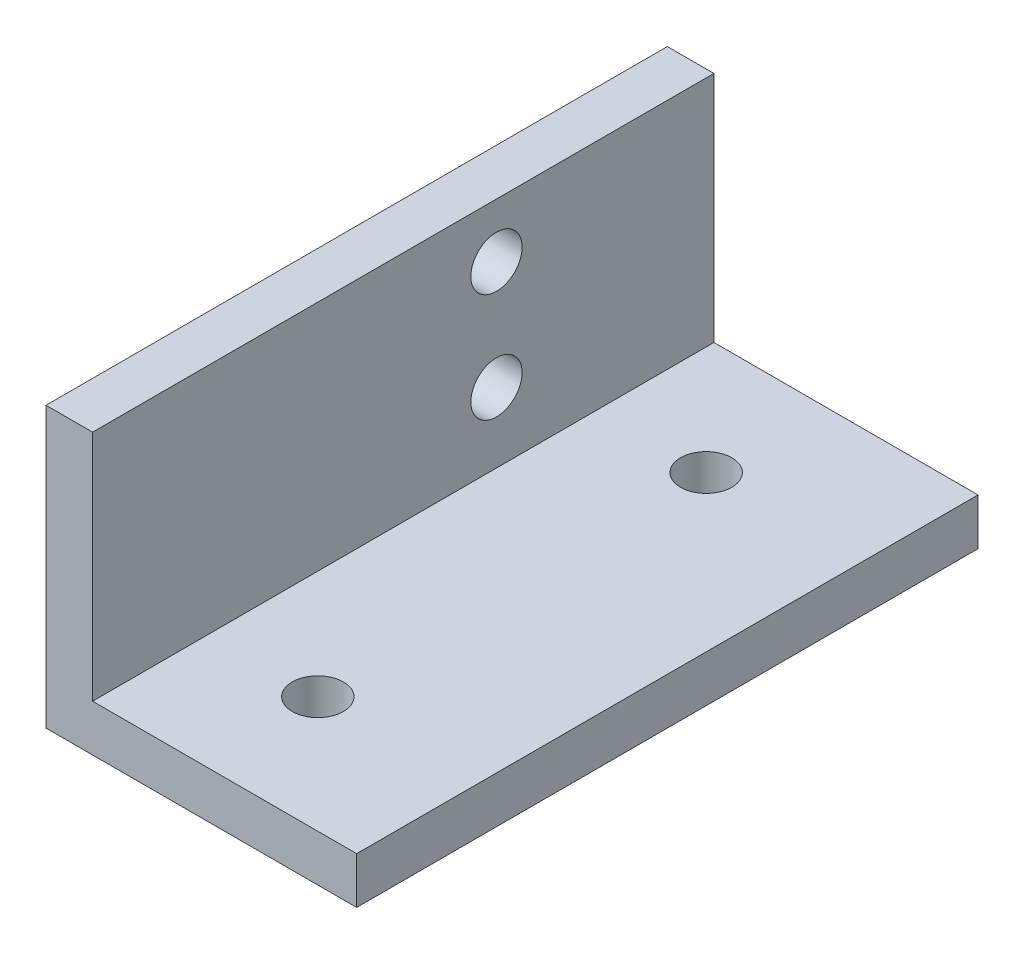
ISO-10303-21;
HEADER;
FILE_DESCRIPTION(('STEP AP214'),'2;1');
FILE_NAME('part.step','',(''),(''),'','','');
FILE_SCHEMA(('AUTOMOTIVE_DESIGN { 1 0 10303 214 1 1 1 1 }'));
ENDSEC;
DATA;
#1=APPLICATION_CONTEXT('core data for automotive mechanical design processes');
#2=APPLICATION_PROTOCOL_DEFINITION('international standard','automotive_design',2000,#1);
#3=PRODUCT_CONTEXT('',#1,'mechanical');
#4=PRODUCT('Part','Part','',(#3));
#5=PRODUCT_RELATED_PRODUCT_CATEGORY('part','',(#4));
#6=PRODUCT_DEFINITION_FORMATION('','',#4);
#7=PRODUCT_DEFINITION_CONTEXT('part definition',#1,'design');
#8=PRODUCT_DEFINITION('design','',#6,#7);
#9=PRODUCT_DEFINITION_SHAPE('','',#8);
#10=(LENGTH_UNIT() NAMED_UNIT(*) SI_UNIT(.MILLI.,.METRE.));
#11=(NAMED_UNIT(*) PLANE_ANGLE_UNIT() SI_UNIT($,.RADIAN.));
#12=(NAMED_UNIT(*) SI_UNIT($,.STERADIAN.) SOLID_ANGLE_UNIT());
#13=UNCERTAINTY_MEASURE_WITH_UNIT(LENGTH_MEASURE(1.E-05),#10,'distance_accuracy_value','');
#14=(GEOMETRIC_REPRESENTATION_CONTEXT(3) GLOBAL_UNCERTAINTY_ASSIGNED_CONTEXT((#13)) GLOBAL_UNIT_ASSIGNED_CONTEXT((#10,
#11,#12)) REPRESENTATION_CONTEXT('',''));
#15=CARTESIAN_POINT('',(0.,0.,0.));
#16=DIRECTION('',(0.,0.,1.));
#17=DIRECTION('',(1.,0.,0.));
#18=AXIS2_PLACEMENT_3D('',#15,#16,#17);
#19=CARTESIAN_POINT('',(20.,0.,40.));
#20=DIRECTION('',(-1.,0.,0.));
#21=DIRECTION('',(0.,0.,1.));
#22=AXIS2_PLACEMENT_3D('',#19,#20,#21);
#23=PLANE('',#22);
#24=DIRECTION('',(0.,1.,0.));
#25=VECTOR('',#24,1.);
#26=CARTESIAN_POINT('',(20.,0.,0.));
#27=LINE('',#26,#25);
#28=CARTESIAN_POINT('',(20.,0.,0.));
#29=VERTEX_POINT('',#28);
#30=CARTESIAN_POINT('',(20.,3.,0.));
#31=VERTEX_POINT('',#30);
#32=EDGE_CURVE('E117',#29,#31,#27,.T.);
#33=ORIENTED_EDGE('',*,*,#32,.T.);
#34=DIRECTION('',(0.,0.,-1.));
#35=VECTOR('',#34,1.);
#36=CARTESIAN_POINT('',(20.,3.,40.));
#37=LINE('',#36,#35);
#38=CARTESIAN_POINT('',(20.,3.,40.));
#39=VERTEX_POINT('',#38);
#40=EDGE_CURVE('E11',#39,#31,#37,.T.);
#41=ORIENTED_EDGE('',*,*,#40,.F.);
#42=DIRECTION('',(0.,1.,0.));
#43=VECTOR('',#42,1.);
#44=CARTESIAN_POINT('',(20.,0.,40.));
#45=LINE('',#44,#43);
#46=CARTESIAN_POINT('',(20.,0.,40.));
#47=VERTEX_POINT('',#46);
#48=EDGE_CURVE('E128',#47,#39,#45,.T.);
#49=ORIENTED_EDGE('',*,*,#48,.F.);
#50=DIRECTION('',(0.,0.,-1.));
#51=VECTOR('',#50,1.);
#52=CARTESIAN_POINT('',(20.,0.,40.));
#53=LINE('',#52,#51);
#54=EDGE_CURVE('E113',#47,#29,#53,.T.);
#55=ORIENTED_EDGE('',*,*,#54,.T.);
#56=EDGE_LOOP('',(#33,#41,#49,#55));
#57=FACE_BOUND('',#56,.T.);
#58=ADVANCED_FACE('F33',(#57),#23,.F.);
#59=CARTESIAN_POINT('',(20.,3.,40.));
#60=DIRECTION('',(0.,-1.,0.));
#61=DIRECTION('',(1.,0.,0.));
#62=AXIS2_PLACEMENT_3D('',#59,#60,#61);
#63=PLANE('',#62);
#64=CARTESIAN_POINT('',(10.,3.,32.5));
#65=DIRECTION('',(0.,-1.,0.));
#66=DIRECTION('',(1.,0.,0.));
#67=AXIS2_PLACEMENT_3D('',#64,#65,#66);
#68=CIRCLE('',#67,1.65);
#69=CARTESIAN_POINT('',(11.65,3.,32.5));
#70=VERTEX_POINT('',#69);
#71=EDGE_CURVE('E262',#70,#70,#68,.T.);
#72=ORIENTED_EDGE('',*,*,#71,.T.);
#73=EDGE_LOOP('',(#72));
#74=FACE_BOUND('',#73,.T.);
#75=CARTESIAN_POINT('',(10.,3.,7.5));
#76=DIRECTION('',(0.,-1.,0.));
#77=DIRECTION('',(1.,0.,0.));
#78=AXIS2_PLACEMENT_3D('',#75,#76,#77);
#79=CIRCLE('',#78,1.65);
#80=CARTESIAN_POINT('',(11.65,3.,7.5));
#81=VERTEX_POINT('',#80);
#82=EDGE_CURVE('E121',#81,#81,#79,.T.);
#83=ORIENTED_EDGE('',*,*,#82,.T.);
#84=EDGE_LOOP('',(#83));
#85=FACE_BOUND('',#84,.T.);
#86=DIRECTION('',(-1.,0.,0.));
#87=VECTOR('',#86,1.);
#88=CARTESIAN_POINT('',(20.,3.,0.));
#89=LINE('',#88,#87);
#90=CARTESIAN_POINT('',(3.,3.,0.));
#91=VERTEX_POINT('',#90);
#92=EDGE_CURVE('E120',#31,#91,#89,.T.);
#93=ORIENTED_EDGE('',*,*,#92,.T.);
#94=DIRECTION('',(0.,0.,-1.));
#95=VECTOR('',#94,1.);
#96=CARTESIAN_POINT('',(3.,3.,40.));
#97=LINE('',#96,#95);
#98=CARTESIAN_POINT('',(3.,3.,40.));
#99=VERTEX_POINT('',#98);
#100=EDGE_CURVE('E41',#99,#91,#97,.T.);
#101=ORIENTED_EDGE('',*,*,#100,.F.);
#102=DIRECTION('',(-1.,0.,0.));
#103=VECTOR('',#102,1.);
#104=CARTESIAN_POINT('',(20.,3.,40.));
#105=LINE('',#104,#103);
#106=EDGE_CURVE('E86',#39,#99,#105,.T.);
#107=ORIENTED_EDGE('',*,*,#106,.F.);
#108=ORIENTED_EDGE('',*,*,#40,.T.);
#109=EDGE_LOOP('',(#93,#101,#107,#108));
#110=FACE_BOUND('',#109,.T.);
#111=ADVANCED_FACE('F156',(#74,#85,#110),#63,.F.);
#112=CARTESIAN_POINT('',(3.,3.,40.));
#113=DIRECTION('',(-1.,0.,0.));
#114=DIRECTION('',(0.,0.,1.));
#115=AXIS2_PLACEMENT_3D('',#112,#113,#114);
#116=PLANE('',#115);
#117=CARTESIAN_POINT('',(3.,14.5,14.));
#118=DIRECTION('',(-1.,0.,0.));
#119=DIRECTION('',(0.,0.,1.));
#120=AXIS2_PLACEMENT_3D('',#117,#118,#119);
#121=CIRCLE('',#120,1.65);
#122=CARTESIAN_POINT('',(3.,14.5,15.65));
#123=VERTEX_POINT('',#122);
#124=EDGE_CURVE('E277',#123,#123,#121,.T.);
#125=ORIENTED_EDGE('',*,*,#124,.T.);
#126=EDGE_LOOP('',(#125));
#127=FACE_BOUND('',#126,.T.);
#128=CARTESIAN_POINT('',(3.,7.5,14.));
#129=DIRECTION('',(-1.,0.,0.));
#130=DIRECTION('',(0.,0.,1.));
#131=AXIS2_PLACEMENT_3D('',#128,#129,#130);
#132=CIRCLE('',#131,1.65);
#133=CARTESIAN_POINT('',(3.,7.5,15.65));
#134=VERTEX_POINT('',#133);
#135=EDGE_CURVE('E271',#134,#134,#132,.T.);
#136=ORIENTED_EDGE('',*,*,#135,.T.);
#137=EDGE_LOOP('',(#136));
#138=FACE_BOUND('',#137,.T.);
#139=DIRECTION('',(0.,1.,0.));
#140=VECTOR('',#139,1.);
#141=CARTESIAN_POINT('',(3.,3.,0.));
#142=LINE('',#141,#140);
#143=CARTESIAN_POINT('',(3.,18.,0.));
#144=VERTEX_POINT('',#143);
#145=EDGE_CURVE('E123',#91,#144,#142,.T.);
#146=ORIENTED_EDGE('',*,*,#145,.T.);
#147=DIRECTION('',(0.,0.,-1.));
#148=VECTOR('',#147,1.);
#149=CARTESIAN_POINT('',(3.,18.,40.));
#150=LINE('',#149,#148);
#151=CARTESIAN_POINT('',(3.,18.,40.));
#152=VERTEX_POINT('',#151);
#153=EDGE_CURVE('E108',#152,#144,#150,.T.);
#154=ORIENTED_EDGE('',*,*,#153,.F.);
#155=DIRECTION('',(0.,1.,0.));
#156=VECTOR('',#155,1.);
#157=CARTESIAN_POINT('',(3.,3.,40.));
#158=LINE('',#157,#156);
#159=EDGE_CURVE('E99',#99,#152,#158,.T.);
#160=ORIENTED_EDGE('',*,*,#159,.F.);
#161=ORIENTED_EDGE('',*,*,#100,.T.);
#162=EDGE_LOOP('',(#146,#154,#160,#161));
#163=FACE_BOUND('',#162,.T.);
#164=ADVANCED_FACE('F134',(#127,#138,#163),#116,.F.);
#165=CARTESIAN_POINT('',(0.,18.,40.));
#166=DIRECTION('',(0.,-1.,0.));
#167=DIRECTION('',(0.,0.,-1.));
#168=AXIS2_PLACEMENT_3D('',#165,#166,#167);
#169=PLANE('',#168);
#170=DIRECTION('',(-1.,0.,0.));
#171=VECTOR('',#170,1.);
#172=CARTESIAN_POINT('',(0.,18.,0.));
#173=LINE('',#172,#171);
#174=CARTESIAN_POINT('',(0.,18.,0.));
#175=VERTEX_POINT('',#174);
#176=EDGE_CURVE('E107',#144,#175,#173,.T.);
#177=ORIENTED_EDGE('',*,*,#176,.T.);
#178=DIRECTION('',(0.,0.,-1.));
#179=VECTOR('',#178,1.);
#180=CARTESIAN_POINT('',(0.,18.,40.));
#181=LINE('',#180,#179);
#182=CARTESIAN_POINT('',(0.,18.,40.));
#183=VERTEX_POINT('',#182);
#184=EDGE_CURVE('E104',#183,#175,#181,.T.);
#185=ORIENTED_EDGE('',*,*,#184,.F.);
#186=DIRECTION('',(-1.,0.,0.));
#187=VECTOR('',#186,1.);
#188=CARTESIAN_POINT('',(0.,18.,40.));
#189=LINE('',#188,#187);
#190=EDGE_CURVE('E93',#152,#183,#189,.T.);
#191=ORIENTED_EDGE('',*,*,#190,.F.);
#192=ORIENTED_EDGE('',*,*,#153,.T.);
#193=EDGE_LOOP('',(#177,#185,#191,#192));
#194=FACE_BOUND('',#193,.T.);
#195=ADVANCED_FACE('F105',(#194),#169,.F.);
#196=CARTESIAN_POINT('',(0.,0.,40.));
#197=DIRECTION('',(1.,0.,0.));
#198=DIRECTION('',(0.,0.,-1.));
#199=AXIS2_PLACEMENT_3D('',#196,#197,#198);
#200=PLANE('',#199);
#201=CARTESIAN_POINT('',(0.,14.5,14.));
#202=DIRECTION('',(-1.,0.,0.));
#203=DIRECTION('',(0.,0.,1.));
#204=AXIS2_PLACEMENT_3D('',#201,#202,#203);
#205=CIRCLE('',#204,1.65);
#206=CARTESIAN_POINT('',(0.,14.5,15.65));
#207=VERTEX_POINT('',#206);
#208=EDGE_CURVE('E280',#207,#207,#205,.T.);
#209=ORIENTED_EDGE('',*,*,#208,.F.);
#210=EDGE_LOOP('',(#209));
#211=FACE_BOUND('',#210,.T.);
#212=CARTESIAN_POINT('',(0.,7.5,14.));
#213=DIRECTION('',(-1.,0.,0.));
#214=DIRECTION('',(0.,0.,1.));
#215=AXIS2_PLACEMENT_3D('',#212,#213,#214);
#216=CIRCLE('',#215,1.65);
#217=CARTESIAN_POINT('',(0.,7.5,15.65));
#218=VERTEX_POINT('',#217);
#219=EDGE_CURVE('E274',#218,#218,#216,.T.);
#220=ORIENTED_EDGE('',*,*,#219,.F.);
#221=EDGE_LOOP('',(#220));
#222=FACE_BOUND('',#221,.T.);
#223=DIRECTION('',(0.,-1.,0.));
#224=VECTOR('',#223,1.);
#225=CARTESIAN_POINT('',(0.,0.,0.));
#226=LINE('',#225,#224);
#227=CARTESIAN_POINT('',(0.,0.,0.));
#228=VERTEX_POINT('',#227);
#229=EDGE_CURVE('E72',#175,#228,#226,.T.);
#230=ORIENTED_EDGE('',*,*,#229,.T.);
#231=DIRECTION('',(0.,0.,-1.));
#232=VECTOR('',#231,1.);
#233=CARTESIAN_POINT('',(0.,0.,40.));
#234=LINE('',#233,#232);
#235=CARTESIAN_POINT('',(0.,0.,40.));
#236=VERTEX_POINT('',#235);
#237=EDGE_CURVE('E109',#236,#228,#234,.T.);
#238=ORIENTED_EDGE('',*,*,#237,.F.);
#239=DIRECTION('',(0.,-1.,0.));
#240=VECTOR('',#239,1.);
#241=CARTESIAN_POINT('',(0.,0.,40.));
#242=LINE('',#241,#240);
#243=EDGE_CURVE('E97',#183,#236,#242,.T.);
#244=ORIENTED_EDGE('',*,*,#243,.F.);
#245=ORIENTED_EDGE('',*,*,#184,.T.);
#246=EDGE_LOOP('',(#230,#238,#244,#245));
#247=FACE_BOUND('',#246,.T.);
#248=ADVANCED_FACE('F111',(#211,#222,#247),#200,.F.);
#249=CARTESIAN_POINT('',(20.,0.,40.));
#250=DIRECTION('',(0.,1.,0.));
#251=DIRECTION('',(-1.,0.,0.));
#252=AXIS2_PLACEMENT_3D('',#249,#250,#251);
#253=PLANE('',#252);
#254=CARTESIAN_POINT('',(10.,0.,32.5));
#255=DIRECTION('',(0.,-1.,0.));
#256=DIRECTION('',(1.,0.,0.));
#257=AXIS2_PLACEMENT_3D('',#254,#255,#256);
#258=CIRCLE('',#257,1.65);
#259=CARTESIAN_POINT('',(11.65,0.,32.5));
#260=VERTEX_POINT('',#259);
#261=EDGE_CURVE('E268',#260,#260,#258,.T.);
#262=ORIENTED_EDGE('',*,*,#261,.F.);
#263=EDGE_LOOP('',(#262));
#264=FACE_BOUND('',#263,.T.);
#265=CARTESIAN_POINT('',(10.,0.,7.5));
#266=DIRECTION('',(0.,-1.,0.));
#267=DIRECTION('',(1.,0.,0.));
#268=AXIS2_PLACEMENT_3D('',#265,#266,#267);
#269=CIRCLE('',#268,1.65);
#270=CARTESIAN_POINT('',(11.65,0.,7.5));
#271=VERTEX_POINT('',#270);
#272=EDGE_CURVE('E258',#271,#271,#269,.T.);
#273=ORIENTED_EDGE('',*,*,#272,.F.);
#274=EDGE_LOOP('',(#273));
#275=FACE_BOUND('',#274,.T.);
#276=DIRECTION('',(1.,0.,0.));
#277=VECTOR('',#276,1.);
#278=CARTESIAN_POINT('',(20.,0.,0.));
#279=LINE('',#278,#277);
#280=EDGE_CURVE('E78',#228,#29,#279,.T.);
#281=ORIENTED_EDGE('',*,*,#280,.T.);
#282=ORIENTED_EDGE('',*,*,#54,.F.);
#283=DIRECTION('',(1.,0.,0.));
#284=VECTOR('',#283,1.);
#285=CARTESIAN_POINT('',(20.,0.,40.));
#286=LINE('',#285,#284);
#287=EDGE_CURVE('E49',#236,#47,#286,.T.);
#288=ORIENTED_EDGE('',*,*,#287,.F.);
#289=ORIENTED_EDGE('',*,*,#237,.T.);
#290=EDGE_LOOP('',(#281,#282,#288,#289));
#291=FACE_BOUND('',#290,.T.);
#292=ADVANCED_FACE('F141',(#264,#275,#291),#253,.F.);
#293=CARTESIAN_POINT('',(0.,0.,40.));
#294=DIRECTION('',(0.,0.,1.));
#295=DIRECTION('',(1.,0.,0.));
#296=AXIS2_PLACEMENT_3D('',#293,#294,#295);
#297=PLANE('',#296);
#298=ORIENTED_EDGE('',*,*,#48,.T.);
#299=ORIENTED_EDGE('',*,*,#106,.T.);
#300=ORIENTED_EDGE('',*,*,#159,.T.);
#301=ORIENTED_EDGE('',*,*,#190,.T.);
#302=ORIENTED_EDGE('',*,*,#243,.T.);
#303=ORIENTED_EDGE('',*,*,#287,.T.);
#304=EDGE_LOOP('',(#298,#299,#300,#301,#302,#303));
#305=FACE_BOUND('',#304,.T.);
#306=ADVANCED_FACE('F95',(#305),#297,.T.);
#307=CARTESIAN_POINT('',(0.,0.,0.));
#308=DIRECTION('',(0.,0.,1.));
#309=DIRECTION('',(1.,0.,0.));
#310=AXIS2_PLACEMENT_3D('',#307,#308,#309);
#311=PLANE('',#310);
#312=ORIENTED_EDGE('',*,*,#32,.F.);
#313=ORIENTED_EDGE('',*,*,#280,.F.);
#314=ORIENTED_EDGE('',*,*,#229,.F.);
#315=ORIENTED_EDGE('',*,*,#176,.F.);
#316=ORIENTED_EDGE('',*,*,#145,.F.);
#317=ORIENTED_EDGE('',*,*,#92,.F.);
#318=EDGE_LOOP('',(#312,#313,#314,#315,#316,#317));
#319=FACE_BOUND('',#318,.T.);
#320=ADVANCED_FACE('F137',(#319),#311,.F.);
#321=CARTESIAN_POINT('',(10.,40.,7.5));
#322=DIRECTION('',(0.,-1.,0.));
#323=DIRECTION('',(1.,0.,0.));
#324=AXIS2_PLACEMENT_3D('',#321,#322,#323);
#325=CYLINDRICAL_SURFACE('',#324,1.65);
#326=ORIENTED_EDGE('',*,*,#272,.T.);
#327=EDGE_LOOP('',(#326));
#328=FACE_BOUND('',#327,.T.);
#329=ORIENTED_EDGE('',*,*,#82,.F.);
#330=EDGE_LOOP('',(#329));
#331=FACE_BOUND('',#330,.T.);
#332=ADVANCED_FACE('F214',(#328,#331),#325,.F.);
#333=CARTESIAN_POINT('',(10.,40.,32.5));
#334=DIRECTION('',(0.,-1.,0.));
#335=DIRECTION('',(1.,0.,0.));
#336=AXIS2_PLACEMENT_3D('',#333,#334,#335);
#337=CYLINDRICAL_SURFACE('',#336,1.65);
#338=ORIENTED_EDGE('',*,*,#261,.T.);
#339=EDGE_LOOP('',(#338));
#340=FACE_BOUND('',#339,.T.);
#341=ORIENTED_EDGE('',*,*,#71,.F.);
#342=EDGE_LOOP('',(#341));
#343=FACE_BOUND('',#342,.T.);
#344=ADVANCED_FACE('F194',(#340,#343),#337,.F.);
#345=CARTESIAN_POINT('',(40.,7.5,14.));
#346=DIRECTION('',(-1.,0.,0.));
#347=DIRECTION('',(0.,0.,1.));
#348=AXIS2_PLACEMENT_3D('',#345,#346,#347);
#349=CYLINDRICAL_SURFACE('',#348,1.65);
#350=ORIENTED_EDGE('',*,*,#219,.T.);
#351=EDGE_LOOP('',(#350));
#352=FACE_BOUND('',#351,.T.);
#353=ORIENTED_EDGE('',*,*,#135,.F.);
#354=EDGE_LOOP('',(#353));
#355=FACE_BOUND('',#354,.T.);
#356=ADVANCED_FACE('F188',(#352,#355),#349,.F.);
#357=CARTESIAN_POINT('',(40.,14.5,14.));
#358=DIRECTION('',(-1.,0.,0.));
#359=DIRECTION('',(0.,0.,1.));
#360=AXIS2_PLACEMENT_3D('',#357,#358,#359);
#361=CYLINDRICAL_SURFACE('',#360,1.65);
#362=ORIENTED_EDGE('',*,*,#208,.T.);
#363=EDGE_LOOP('',(#362));
#364=FACE_BOUND('',#363,.T.);
#365=ORIENTED_EDGE('',*,*,#124,.F.);
#366=EDGE_LOOP('',(#365));
#367=FACE_BOUND('',#366,.T.);
#368=ADVANCED_FACE('F193',(#364,#367),#361,.F.);
#369=CLOSED_SHELL('',(#58,#111,#164,#195,#248,#292,#306,#320,#332,#344,#356,#368));
#370=MANIFOLD_SOLID_BREP('B2',#369);
#371=ADVANCED_BREP_SHAPE_REPRESENTATION('',(#18,#370),#14);
#372=SHAPE_DEFINITION_REPRESENTATION(#9,#371);
ENDSEC;
END-ISO-10303-21;
